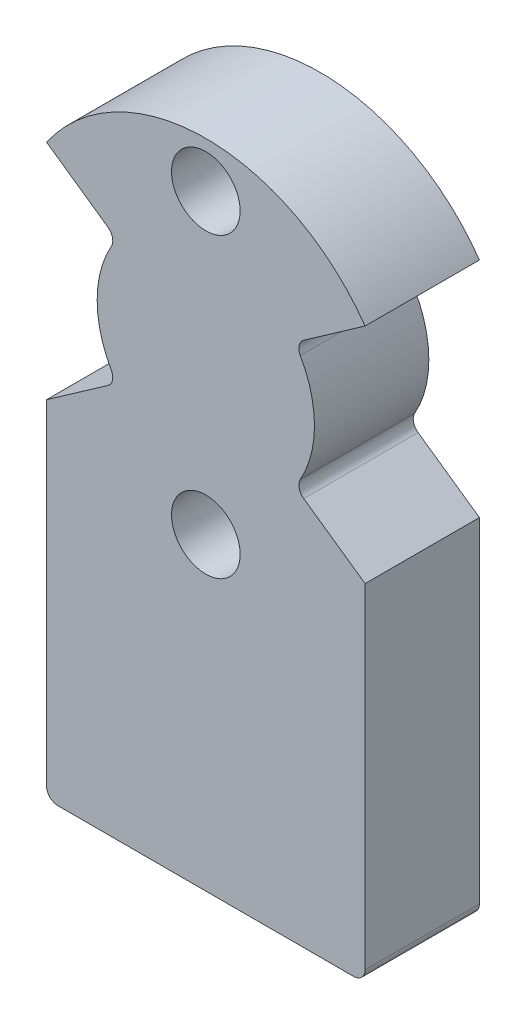
ISO-10303-21;
HEADER;
FILE_DESCRIPTION(('STEP AP214'),'2;1');
FILE_NAME('part.step','',(''),(''),'','','');
FILE_SCHEMA(('AUTOMOTIVE_DESIGN { 1 0 10303 214 1 1 1 1 }'));
ENDSEC;
DATA;
#1=APPLICATION_CONTEXT('core data for automotive mechanical design processes');
#2=APPLICATION_PROTOCOL_DEFINITION('international standard','automotive_design',2000,#1);
#3=PRODUCT_CONTEXT('',#1,'mechanical');
#4=PRODUCT('Part','Part','',(#3));
#5=PRODUCT_RELATED_PRODUCT_CATEGORY('part','',(#4));
#6=PRODUCT_DEFINITION_FORMATION('','',#4);
#7=PRODUCT_DEFINITION_CONTEXT('part definition',#1,'design');
#8=PRODUCT_DEFINITION('design','',#6,#7);
#9=PRODUCT_DEFINITION_SHAPE('','',#8);
#10=(LENGTH_UNIT() NAMED_UNIT(*) SI_UNIT(.MILLI.,.METRE.));
#11=(NAMED_UNIT(*) PLANE_ANGLE_UNIT() SI_UNIT($,.RADIAN.));
#12=(NAMED_UNIT(*) SI_UNIT($,.STERADIAN.) SOLID_ANGLE_UNIT());
#13=UNCERTAINTY_MEASURE_WITH_UNIT(LENGTH_MEASURE(1.E-05),#10,'distance_accuracy_value','');
#14=(GEOMETRIC_REPRESENTATION_CONTEXT(3) GLOBAL_UNCERTAINTY_ASSIGNED_CONTEXT((#13)) GLOBAL_UNIT_ASSIGNED_CONTEXT((#10,
#11,#12)) REPRESENTATION_CONTEXT('',''));
#15=CARTESIAN_POINT('',(0.,0.,0.));
#16=DIRECTION('',(0.,0.,1.));
#17=DIRECTION('',(1.,0.,0.));
#18=AXIS2_PLACEMENT_3D('',#15,#16,#17);
#19=CARTESIAN_POINT('',(0.,0.,5.));
#20=DIRECTION('',(0.,0.,1.));
#21=DIRECTION('',(1.,0.,0.));
#22=AXIS2_PLACEMENT_3D('',#19,#20,#21);
#23=PLANE('',#22);
#24=CARTESIAN_POINT('',(0.,6.5,5.));
#25=DIRECTION('',(0.,0.,1.));
#26=DIRECTION('',(1.,0.,0.));
#27=AXIS2_PLACEMENT_3D('',#24,#25,#26);
#28=CIRCLE('',#27,1.5);
#29=CARTESIAN_POINT('',(1.5,6.5,5.));
#30=VERTEX_POINT('',#29);
#31=EDGE_CURVE('E224',#30,#30,#28,.T.);
#32=ORIENTED_EDGE('',*,*,#31,.F.);
#33=EDGE_LOOP('',(#32));
#34=FACE_BOUND('',#33,.T.);
#35=CARTESIAN_POINT('',(0.,-6.5,5.));
#36=DIRECTION('',(0.,0.,1.));
#37=DIRECTION('',(1.,0.,0.));
#38=AXIS2_PLACEMENT_3D('',#35,#36,#37);
#39=CIRCLE('',#38,1.5);
#40=CARTESIAN_POINT('',(1.5,-6.5,5.));
#41=VERTEX_POINT('',#40);
#42=EDGE_CURVE('E219',#41,#41,#39,.T.);
#43=ORIENTED_EDGE('',*,*,#42,.F.);
#44=EDGE_LOOP('',(#43));
#45=FACE_BOUND('',#44,.T.);
#46=DIRECTION('',(-1.,0.,0.));
#47=VECTOR('',#46,1.);
#48=CARTESIAN_POINT('',(0.,-20.,5.));
#49=LINE('',#48,#47);
#50=CARTESIAN_POINT('',(6.46279237645642,-20.,5.));
#51=VERTEX_POINT('',#50);
#52=CARTESIAN_POINT('',(-6.46279237645642,-20.,5.));
#53=VERTEX_POINT('',#52);
#54=EDGE_CURVE('E190',#51,#53,#49,.T.);
#55=ORIENTED_EDGE('',*,*,#54,.F.);
#56=CARTESIAN_POINT('',(6.46279237645642,-19.5,5.));
#57=DIRECTION('',(0.,0.,1.));
#58=DIRECTION('',(1.,0.,0.));
#59=AXIS2_PLACEMENT_3D('',#56,#57,#58);
#60=CIRCLE('',#59,0.5);
#61=CARTESIAN_POINT('',(6.96279237645642,-19.5,5.));
#62=VERTEX_POINT('',#61);
#63=EDGE_CURVE('E46',#51,#62,#60,.T.);
#64=ORIENTED_EDGE('',*,*,#63,.T.);
#65=DIRECTION('',(0.,-1.,0.));
#66=VECTOR('',#65,1.);
#67=CARTESIAN_POINT('',(6.96279237645642,0.,5.));
#68=LINE('',#67,#66);
#69=CARTESIAN_POINT('',(6.96279237645642,-4.8753997089839,5.));
#70=VERTEX_POINT('',#69);
#71=EDGE_CURVE('E283',#70,#62,#68,.T.);
#72=ORIENTED_EDGE('',*,*,#71,.F.);
#73=DIRECTION('',(0.819152044288991,-0.573576436351047,0.));
#74=VECTOR('',#73,1.);
#75=CARTESIAN_POINT('',(0.,0.,5.));
#76=LINE('',#75,#74);
#77=CARTESIAN_POINT('',(4.28100018480391,-2.99758860047687,5.));
#78=VERTEX_POINT('',#77);
#79=EDGE_CURVE('E168',#78,#70,#76,.T.);
#80=ORIENTED_EDGE('',*,*,#79,.F.);
#81=CARTESIAN_POINT('',(4.56778840297943,-2.58801257833237,5.));
#82=DIRECTION('',(0.,0.,1.));
#83=DIRECTION('',(1.,0.,0.));
#84=AXIS2_PLACEMENT_3D('',#81,#82,#83);
#85=CIRCLE('',#84,0.5);
#86=CARTESIAN_POINT('',(4.13276093602901,-2.34153518991977,5.));
#87=VERTEX_POINT('',#86);
#88=EDGE_CURVE('E270',#78,#87,#85,.F.);
#89=ORIENTED_EDGE('',*,*,#88,.T.);
#90=CARTESIAN_POINT('',(0.,0.,5.));
#91=DIRECTION('',(0.,0.,1.));
#92=DIRECTION('',(1.,0.,0.));
#93=AXIS2_PLACEMENT_3D('',#90,#91,#92);
#94=CIRCLE('',#93,4.75);
#95=CARTESIAN_POINT('',(4.13276093602901,2.34153518991977,5.));
#96=VERTEX_POINT('',#95);
#97=EDGE_CURVE('E161',#87,#96,#94,.T.);
#98=ORIENTED_EDGE('',*,*,#97,.T.);
#99=CARTESIAN_POINT('',(4.56778840297943,2.58801257833237,5.));
#100=DIRECTION('',(0.,0.,1.));
#101=DIRECTION('',(1.,0.,0.));
#102=AXIS2_PLACEMENT_3D('',#99,#100,#101);
#103=CIRCLE('',#102,0.5);
#104=CARTESIAN_POINT('',(4.28100018480391,2.99758860047687,5.));
#105=VERTEX_POINT('',#104);
#106=EDGE_CURVE('E267',#96,#105,#103,.F.);
#107=ORIENTED_EDGE('',*,*,#106,.T.);
#108=DIRECTION('',(0.819152044288991,0.573576436351047,0.));
#109=VECTOR('',#108,1.);
#110=CARTESIAN_POINT('',(0.,0.,5.));
#111=LINE('',#110,#109);
#112=CARTESIAN_POINT('',(6.96279237645642,4.8753997089839,5.));
#113=VERTEX_POINT('',#112);
#114=EDGE_CURVE('E193',#105,#113,#111,.T.);
#115=ORIENTED_EDGE('',*,*,#114,.T.);
#116=CARTESIAN_POINT('',(0.,0.,5.));
#117=DIRECTION('',(0.,0.,1.));
#118=DIRECTION('',(1.,0.,0.));
#119=AXIS2_PLACEMENT_3D('',#116,#117,#118);
#120=CIRCLE('',#119,8.5);
#121=CARTESIAN_POINT('',(-6.96279237645642,4.8753997089839,5.));
#122=VERTEX_POINT('',#121);
#123=EDGE_CURVE('E232',#113,#122,#120,.T.);
#124=ORIENTED_EDGE('',*,*,#123,.T.);
#125=DIRECTION('',(-0.819152044288991,0.573576436351047,0.));
#126=VECTOR('',#125,1.);
#127=CARTESIAN_POINT('',(0.,0.,5.));
#128=LINE('',#127,#126);
#129=CARTESIAN_POINT('',(-4.28100018480391,2.99758860047687,5.));
#130=VERTEX_POINT('',#129);
#131=EDGE_CURVE('E209',#130,#122,#128,.T.);
#132=ORIENTED_EDGE('',*,*,#131,.F.);
#133=CARTESIAN_POINT('',(-4.56778840297943,2.58801257833237,5.));
#134=DIRECTION('',(0.,0.,1.));
#135=DIRECTION('',(1.,0.,0.));
#136=AXIS2_PLACEMENT_3D('',#133,#134,#135);
#137=CIRCLE('',#136,0.5);
#138=CARTESIAN_POINT('',(-4.13276093602901,2.34153518991977,5.));
#139=VERTEX_POINT('',#138);
#140=EDGE_CURVE('E263',#130,#139,#137,.F.);
#141=ORIENTED_EDGE('',*,*,#140,.T.);
#142=CARTESIAN_POINT('',(0.,0.,5.));
#143=DIRECTION('',(0.,0.,-1.));
#144=DIRECTION('',(-1.,0.,0.));
#145=AXIS2_PLACEMENT_3D('',#142,#143,#144);
#146=CIRCLE('',#145,4.75);
#147=CARTESIAN_POINT('',(-4.13276093602901,-2.34153518991977,5.));
#148=VERTEX_POINT('',#147);
#149=EDGE_CURVE('E203',#148,#139,#146,.T.);
#150=ORIENTED_EDGE('',*,*,#149,.F.);
#151=CARTESIAN_POINT('',(-4.56778840297943,-2.58801257833237,5.));
#152=DIRECTION('',(0.,0.,1.));
#153=DIRECTION('',(1.,0.,0.));
#154=AXIS2_PLACEMENT_3D('',#151,#152,#153);
#155=CIRCLE('',#154,0.5);
#156=CARTESIAN_POINT('',(-4.28100018480391,-2.99758860047687,5.));
#157=VERTEX_POINT('',#156);
#158=EDGE_CURVE('E259',#148,#157,#155,.F.);
#159=ORIENTED_EDGE('',*,*,#158,.T.);
#160=DIRECTION('',(-0.819152044288991,-0.573576436351047,0.));
#161=VECTOR('',#160,1.);
#162=CARTESIAN_POINT('',(0.,0.,5.));
#163=LINE('',#162,#161);
#164=CARTESIAN_POINT('',(-6.96279237645642,-4.8753997089839,5.));
#165=VERTEX_POINT('',#164);
#166=EDGE_CURVE('E206',#157,#165,#163,.T.);
#167=ORIENTED_EDGE('',*,*,#166,.T.);
#168=DIRECTION('',(0.,-1.,0.));
#169=VECTOR('',#168,1.);
#170=CARTESIAN_POINT('',(-6.96279237645642,0.,5.));
#171=LINE('',#170,#169);
#172=CARTESIAN_POINT('',(-6.96279237645642,-19.5,5.));
#173=VERTEX_POINT('',#172);
#174=EDGE_CURVE('E183',#165,#173,#171,.T.);
#175=ORIENTED_EDGE('',*,*,#174,.T.);
#176=CARTESIAN_POINT('',(-6.46279237645642,-19.5,5.));
#177=DIRECTION('',(0.,0.,1.));
#178=DIRECTION('',(1.,0.,0.));
#179=AXIS2_PLACEMENT_3D('',#176,#177,#178);
#180=CIRCLE('',#179,0.5);
#181=EDGE_CURVE('E58',#173,#53,#180,.T.);
#182=ORIENTED_EDGE('',*,*,#181,.T.);
#183=EDGE_LOOP('',(#55,#64,#72,#80,#89,#98,#107,#115,#124,#132,#141,#150,#159,#167,#175,#182));
#184=FACE_BOUND('',#183,.T.);
#185=ADVANCED_FACE('F38',(#34,#45,#184),#23,.T.);
#186=CARTESIAN_POINT('',(0.,0.,0.));
#187=DIRECTION('',(0.,0.,1.));
#188=DIRECTION('',(1.,0.,0.));
#189=AXIS2_PLACEMENT_3D('',#186,#187,#188);
#190=PLANE('',#189);
#191=CARTESIAN_POINT('',(0.,6.5,0.));
#192=DIRECTION('',(0.,0.,1.));
#193=DIRECTION('',(1.,0.,0.));
#194=AXIS2_PLACEMENT_3D('',#191,#192,#193);
#195=CIRCLE('',#194,1.5);
#196=CARTESIAN_POINT('',(1.5,6.5,0.));
#197=VERTEX_POINT('',#196);
#198=EDGE_CURVE('E220',#197,#197,#195,.T.);
#199=ORIENTED_EDGE('',*,*,#198,.T.);
#200=EDGE_LOOP('',(#199));
#201=FACE_BOUND('',#200,.T.);
#202=CARTESIAN_POINT('',(0.,-6.5,0.));
#203=DIRECTION('',(0.,0.,1.));
#204=DIRECTION('',(1.,0.,0.));
#205=AXIS2_PLACEMENT_3D('',#202,#203,#204);
#206=CIRCLE('',#205,1.5);
#207=CARTESIAN_POINT('',(1.5,-6.5,0.));
#208=VERTEX_POINT('',#207);
#209=EDGE_CURVE('E227',#208,#208,#206,.T.);
#210=ORIENTED_EDGE('',*,*,#209,.T.);
#211=EDGE_LOOP('',(#210));
#212=FACE_BOUND('',#211,.T.);
#213=DIRECTION('',(0.,-1.,0.));
#214=VECTOR('',#213,1.);
#215=CARTESIAN_POINT('',(6.96279237645642,0.,0.));
#216=LINE('',#215,#214);
#217=CARTESIAN_POINT('',(6.96279237645643,-4.8753997089839,0.));
#218=VERTEX_POINT('',#217);
#219=CARTESIAN_POINT('',(6.96279237645642,-19.5,0.));
#220=VERTEX_POINT('',#219);
#221=EDGE_CURVE('E156',#218,#220,#216,.T.);
#222=ORIENTED_EDGE('',*,*,#221,.T.);
#223=CARTESIAN_POINT('',(6.46279237645642,-19.5,0.));
#224=DIRECTION('',(0.,0.,1.));
#225=DIRECTION('',(1.,0.,0.));
#226=AXIS2_PLACEMENT_3D('',#223,#224,#225);
#227=CIRCLE('',#226,0.5);
#228=CARTESIAN_POINT('',(6.46279237645642,-20.,0.));
#229=VERTEX_POINT('',#228);
#230=EDGE_CURVE('E275',#220,#229,#227,.F.);
#231=ORIENTED_EDGE('',*,*,#230,.T.);
#232=DIRECTION('',(-1.,0.,0.));
#233=VECTOR('',#232,1.);
#234=CARTESIAN_POINT('',(0.,-20.,0.));
#235=LINE('',#234,#233);
#236=CARTESIAN_POINT('',(-6.46279237645642,-20.,0.));
#237=VERTEX_POINT('',#236);
#238=EDGE_CURVE('E179',#229,#237,#235,.T.);
#239=ORIENTED_EDGE('',*,*,#238,.T.);
#240=CARTESIAN_POINT('',(-6.46279237645642,-19.5,0.));
#241=DIRECTION('',(0.,0.,1.));
#242=DIRECTION('',(1.,0.,0.));
#243=AXIS2_PLACEMENT_3D('',#240,#241,#242);
#244=CIRCLE('',#243,0.5);
#245=CARTESIAN_POINT('',(-6.96279237645642,-19.5,0.));
#246=VERTEX_POINT('',#245);
#247=EDGE_CURVE('E273',#237,#246,#244,.F.);
#248=ORIENTED_EDGE('',*,*,#247,.T.);
#249=DIRECTION('',(0.,-1.,0.));
#250=VECTOR('',#249,1.);
#251=CARTESIAN_POINT('',(-6.96279237645642,0.,0.));
#252=LINE('',#251,#250);
#253=CARTESIAN_POINT('',(-6.96279237645642,-4.8753997089839,0.));
#254=VERTEX_POINT('',#253);
#255=EDGE_CURVE('E180',#254,#246,#252,.T.);
#256=ORIENTED_EDGE('',*,*,#255,.F.);
#257=DIRECTION('',(-0.819152044288991,-0.573576436351047,0.));
#258=VECTOR('',#257,1.);
#259=CARTESIAN_POINT('',(0.,0.,0.));
#260=LINE('',#259,#258);
#261=CARTESIAN_POINT('',(-4.28100018480391,-2.99758860047687,0.));
#262=VERTEX_POINT('',#261);
#263=EDGE_CURVE('E214',#262,#254,#260,.T.);
#264=ORIENTED_EDGE('',*,*,#263,.F.);
#265=CARTESIAN_POINT('',(-4.56778840297943,-2.58801257833237,0.));
#266=DIRECTION('',(0.,0.,1.));
#267=DIRECTION('',(1.,0.,0.));
#268=AXIS2_PLACEMENT_3D('',#265,#266,#267);
#269=CIRCLE('',#268,0.5);
#270=CARTESIAN_POINT('',(-4.13276093602901,-2.34153518991977,0.));
#271=VERTEX_POINT('',#270);
#272=EDGE_CURVE('E257',#262,#271,#269,.T.);
#273=ORIENTED_EDGE('',*,*,#272,.T.);
#274=CARTESIAN_POINT('',(0.,0.,0.));
#275=DIRECTION('',(0.,0.,-1.));
#276=DIRECTION('',(-1.,0.,0.));
#277=AXIS2_PLACEMENT_3D('',#274,#275,#276);
#278=CIRCLE('',#277,4.75);
#279=CARTESIAN_POINT('',(-4.13276093602901,2.34153518991977,0.));
#280=VERTEX_POINT('',#279);
#281=EDGE_CURVE('E202',#271,#280,#278,.T.);
#282=ORIENTED_EDGE('',*,*,#281,.T.);
#283=CARTESIAN_POINT('',(-4.56778840297943,2.58801257833237,0.));
#284=DIRECTION('',(0.,0.,1.));
#285=DIRECTION('',(1.,0.,0.));
#286=AXIS2_PLACEMENT_3D('',#283,#284,#285);
#287=CIRCLE('',#286,0.5);
#288=CARTESIAN_POINT('',(-4.28100018480391,2.99758860047687,0.));
#289=VERTEX_POINT('',#288);
#290=EDGE_CURVE('E261',#280,#289,#287,.T.);
#291=ORIENTED_EDGE('',*,*,#290,.T.);
#292=DIRECTION('',(-0.819152044288991,0.573576436351047,0.));
#293=VECTOR('',#292,1.);
#294=CARTESIAN_POINT('',(0.,0.,0.));
#295=LINE('',#294,#293);
#296=CARTESIAN_POINT('',(-6.96279237645642,4.8753997089839,0.));
#297=VERTEX_POINT('',#296);
#298=EDGE_CURVE('E207',#289,#297,#295,.T.);
#299=ORIENTED_EDGE('',*,*,#298,.T.);
#300=CARTESIAN_POINT('',(0.,0.,0.));
#301=DIRECTION('',(0.,0.,1.));
#302=DIRECTION('',(1.,0.,0.));
#303=AXIS2_PLACEMENT_3D('',#300,#301,#302);
#304=CIRCLE('',#303,8.5);
#305=CARTESIAN_POINT('',(6.96279237645642,4.8753997089839,0.));
#306=VERTEX_POINT('',#305);
#307=EDGE_CURVE('E223',#306,#297,#304,.T.);
#308=ORIENTED_EDGE('',*,*,#307,.F.);
#309=DIRECTION('',(0.819152044288991,0.573576436351047,0.));
#310=VECTOR('',#309,1.);
#311=CARTESIAN_POINT('',(0.,0.,0.));
#312=LINE('',#311,#310);
#313=CARTESIAN_POINT('',(4.28100018480391,2.99758860047687,0.));
#314=VERTEX_POINT('',#313);
#315=EDGE_CURVE('E162',#314,#306,#312,.T.);
#316=ORIENTED_EDGE('',*,*,#315,.F.);
#317=CARTESIAN_POINT('',(4.56778840297943,2.58801257833237,0.));
#318=DIRECTION('',(0.,0.,1.));
#319=DIRECTION('',(1.,0.,0.));
#320=AXIS2_PLACEMENT_3D('',#317,#318,#319);
#321=CIRCLE('',#320,0.5);
#322=CARTESIAN_POINT('',(4.13276093602901,2.34153518991977,0.));
#323=VERTEX_POINT('',#322);
#324=EDGE_CURVE('E265',#314,#323,#321,.T.);
#325=ORIENTED_EDGE('',*,*,#324,.T.);
#326=CARTESIAN_POINT('',(0.,0.,0.));
#327=DIRECTION('',(0.,0.,1.));
#328=DIRECTION('',(1.,0.,0.));
#329=AXIS2_PLACEMENT_3D('',#326,#327,#328);
#330=CIRCLE('',#329,4.75);
#331=CARTESIAN_POINT('',(4.13276093602901,-2.34153518991977,0.));
#332=VERTEX_POINT('',#331);
#333=EDGE_CURVE('E172',#332,#323,#330,.T.);
#334=ORIENTED_EDGE('',*,*,#333,.F.);
#335=CARTESIAN_POINT('',(4.56778840297943,-2.58801257833237,0.));
#336=DIRECTION('',(0.,0.,1.));
#337=DIRECTION('',(1.,0.,0.));
#338=AXIS2_PLACEMENT_3D('',#335,#336,#337);
#339=CIRCLE('',#338,0.5);
#340=CARTESIAN_POINT('',(4.28100018480391,-2.99758860047687,0.));
#341=VERTEX_POINT('',#340);
#342=EDGE_CURVE('E158',#332,#341,#339,.T.);
#343=ORIENTED_EDGE('',*,*,#342,.T.);
#344=DIRECTION('',(0.819152044288991,-0.573576436351047,0.));
#345=VECTOR('',#344,1.);
#346=CARTESIAN_POINT('',(0.,0.,0.));
#347=LINE('',#346,#345);
#348=EDGE_CURVE('E152',#341,#218,#347,.T.);
#349=ORIENTED_EDGE('',*,*,#348,.T.);
#350=EDGE_LOOP('',(#222,#231,#239,#248,#256,#264,#273,#282,#291,#299,#308,#316,#325,#334,#343,#349));
#351=FACE_BOUND('',#350,.T.);
#352=ADVANCED_FACE('F154',(#201,#212,#351),#190,.F.);
#353=CARTESIAN_POINT('',(0.,0.,5.));
#354=DIRECTION('',(0.,0.,-1.));
#355=DIRECTION('',(-1.,0.,0.));
#356=AXIS2_PLACEMENT_3D('',#353,#354,#355);
#357=CYLINDRICAL_SURFACE('',#356,8.5);
#358=ORIENTED_EDGE('',*,*,#123,.F.);
#359=DIRECTION('',(0.,0.,-1.));
#360=VECTOR('',#359,1.);
#361=CARTESIAN_POINT('',(6.96279237645642,4.8753997089839,5.));
#362=LINE('',#361,#360);
#363=EDGE_CURVE('E196',#113,#306,#362,.T.);
#364=ORIENTED_EDGE('',*,*,#363,.T.);
#365=ORIENTED_EDGE('',*,*,#307,.T.);
#366=DIRECTION('',(0.,0.,-1.));
#367=VECTOR('',#366,1.);
#368=CARTESIAN_POINT('',(-6.96279237645642,4.8753997089839,5.));
#369=LINE('',#368,#367);
#370=EDGE_CURVE('E211',#122,#297,#369,.T.);
#371=ORIENTED_EDGE('',*,*,#370,.F.);
#372=EDGE_LOOP('',(#358,#364,#365,#371));
#373=FACE_BOUND('',#372,.T.);
#374=ADVANCED_FACE('F322',(#373),#357,.T.);
#375=CARTESIAN_POINT('',(0.,-6.5,0.));
#376=DIRECTION('',(0.,0.,1.));
#377=DIRECTION('',(1.,0.,0.));
#378=AXIS2_PLACEMENT_3D('',#375,#376,#377);
#379=CYLINDRICAL_SURFACE('',#378,1.5);
#380=ORIENTED_EDGE('',*,*,#209,.F.);
#381=EDGE_LOOP('',(#380));
#382=FACE_BOUND('',#381,.T.);
#383=ORIENTED_EDGE('',*,*,#42,.T.);
#384=EDGE_LOOP('',(#383));
#385=FACE_BOUND('',#384,.T.);
#386=ADVANCED_FACE('F358',(#382,#385),#379,.F.);
#387=CARTESIAN_POINT('',(0.,6.5,0.));
#388=DIRECTION('',(0.,0.,1.));
#389=DIRECTION('',(1.,0.,0.));
#390=AXIS2_PLACEMENT_3D('',#387,#388,#389);
#391=CYLINDRICAL_SURFACE('',#390,1.5);
#392=ORIENTED_EDGE('',*,*,#198,.F.);
#393=EDGE_LOOP('',(#392));
#394=FACE_BOUND('',#393,.T.);
#395=ORIENTED_EDGE('',*,*,#31,.T.);
#396=EDGE_LOOP('',(#395));
#397=FACE_BOUND('',#396,.T.);
#398=ADVANCED_FACE('F494',(#394,#397),#391,.F.);
#399=CARTESIAN_POINT('',(0.,0.,5.));
#400=DIRECTION('',(0.,0.,-1.));
#401=DIRECTION('',(-1.,0.,0.));
#402=AXIS2_PLACEMENT_3D('',#399,#400,#401);
#403=CYLINDRICAL_SURFACE('',#402,4.75);
#404=ORIENTED_EDGE('',*,*,#281,.F.);
#405=DIRECTION('',(0.,0.,-1.));
#406=VECTOR('',#405,1.);
#407=CARTESIAN_POINT('',(-4.13276093602901,-2.34153518991977,5.));
#408=LINE('',#407,#406);
#409=EDGE_CURVE('E243',#271,#148,#408,.F.);
#410=ORIENTED_EDGE('',*,*,#409,.T.);
#411=ORIENTED_EDGE('',*,*,#149,.T.);
#412=DIRECTION('',(0.,0.,-1.));
#413=VECTOR('',#412,1.);
#414=CARTESIAN_POINT('',(-4.13276093602901,2.34153518991977,5.));
#415=LINE('',#414,#413);
#416=EDGE_CURVE('E240',#139,#280,#415,.T.);
#417=ORIENTED_EDGE('',*,*,#416,.T.);
#418=EDGE_LOOP('',(#404,#410,#411,#417));
#419=FACE_BOUND('',#418,.T.);
#420=ADVANCED_FACE('F305',(#419),#403,.T.);
#421=CARTESIAN_POINT('',(0.,0.,5.));
#422=DIRECTION('',(-0.573576436351047,-0.819152044288991,0.));
#423=DIRECTION('',(0.819152044288991,-0.573576436351047,0.));
#424=AXIS2_PLACEMENT_3D('',#421,#422,#423);
#425=PLANE('',#424);
#426=ORIENTED_EDGE('',*,*,#298,.F.);
#427=DIRECTION('',(0.,0.,1.));
#428=VECTOR('',#427,1.);
#429=CARTESIAN_POINT('',(-4.28100018480391,2.99758860047687,5.));
#430=LINE('',#429,#428);
#431=EDGE_CURVE('E245',#289,#130,#430,.T.);
#432=ORIENTED_EDGE('',*,*,#431,.T.);
#433=ORIENTED_EDGE('',*,*,#131,.T.);
#434=ORIENTED_EDGE('',*,*,#370,.T.);
#435=EDGE_LOOP('',(#426,#432,#433,#434));
#436=FACE_BOUND('',#435,.T.);
#437=ADVANCED_FACE('F318',(#436),#425,.T.);
#438=CARTESIAN_POINT('',(0.,0.,5.));
#439=DIRECTION('',(0.573576436351047,-0.819152044288991,0.));
#440=DIRECTION('',(0.819152044288991,0.573576436351047,0.));
#441=AXIS2_PLACEMENT_3D('',#438,#439,#440);
#442=PLANE('',#441);
#443=ORIENTED_EDGE('',*,*,#166,.F.);
#444=DIRECTION('',(0.,0.,-1.));
#445=VECTOR('',#444,1.);
#446=CARTESIAN_POINT('',(-4.28100018480391,-2.99758860047687,5.));
#447=LINE('',#446,#445);
#448=EDGE_CURVE('E235',#157,#262,#447,.T.);
#449=ORIENTED_EDGE('',*,*,#448,.T.);
#450=ORIENTED_EDGE('',*,*,#263,.T.);
#451=DIRECTION('',(0.,0.,-1.));
#452=VECTOR('',#451,1.);
#453=CARTESIAN_POINT('',(-6.96279237645642,-4.8753997089839,5.));
#454=LINE('',#453,#452);
#455=EDGE_CURVE('E173',#165,#254,#454,.T.);
#456=ORIENTED_EDGE('',*,*,#455,.F.);
#457=EDGE_LOOP('',(#443,#449,#450,#456));
#458=FACE_BOUND('',#457,.T.);
#459=ADVANCED_FACE('F299',(#458),#442,.F.);
#460=CARTESIAN_POINT('',(0.,0.,5.));
#461=DIRECTION('',(0.,0.,-1.));
#462=DIRECTION('',(-1.,0.,0.));
#463=AXIS2_PLACEMENT_3D('',#460,#461,#462);
#464=CYLINDRICAL_SURFACE('',#463,4.75);
#465=ORIENTED_EDGE('',*,*,#333,.T.);
#466=DIRECTION('',(0.,0.,-1.));
#467=VECTOR('',#466,1.);
#468=CARTESIAN_POINT('',(4.13276093602901,2.34153518991977,5.));
#469=LINE('',#468,#467);
#470=EDGE_CURVE('E253',#323,#96,#469,.F.);
#471=ORIENTED_EDGE('',*,*,#470,.T.);
#472=ORIENTED_EDGE('',*,*,#97,.F.);
#473=DIRECTION('',(0.,0.,-1.));
#474=VECTOR('',#473,1.);
#475=CARTESIAN_POINT('',(4.13276093602901,-2.34153518991977,5.));
#476=LINE('',#475,#474);
#477=EDGE_CURVE('E250',#87,#332,#476,.T.);
#478=ORIENTED_EDGE('',*,*,#477,.T.);
#479=EDGE_LOOP('',(#465,#471,#472,#478));
#480=FACE_BOUND('',#479,.T.);
#481=ADVANCED_FACE('F335',(#480),#464,.T.);
#482=CARTESIAN_POINT('',(0.,0.,5.));
#483=DIRECTION('',(0.573576436351047,0.819152044288991,0.));
#484=DIRECTION('',(-0.819152044288991,0.573576436351047,0.));
#485=AXIS2_PLACEMENT_3D('',#482,#483,#484);
#486=PLANE('',#485);
#487=ORIENTED_EDGE('',*,*,#348,.F.);
#488=DIRECTION('',(0.,0.,-1.));
#489=VECTOR('',#488,1.);
#490=CARTESIAN_POINT('',(4.28100018480391,-2.99758860047687,5.));
#491=LINE('',#490,#489);
#492=EDGE_CURVE('E255',#341,#78,#491,.F.);
#493=ORIENTED_EDGE('',*,*,#492,.T.);
#494=ORIENTED_EDGE('',*,*,#79,.T.);
#495=DIRECTION('',(0.,0.,-1.));
#496=VECTOR('',#495,1.);
#497=CARTESIAN_POINT('',(6.96279237645643,-4.8753997089839,5.));
#498=LINE('',#497,#496);
#499=EDGE_CURVE('E165',#70,#218,#498,.T.);
#500=ORIENTED_EDGE('',*,*,#499,.T.);
#501=EDGE_LOOP('',(#487,#493,#494,#500));
#502=FACE_BOUND('',#501,.T.);
#503=ADVANCED_FACE('F166',(#502),#486,.T.);
#504=CARTESIAN_POINT('',(0.,0.,5.));
#505=DIRECTION('',(-0.573576436351047,0.819152044288991,0.));
#506=DIRECTION('',(-0.819152044288991,-0.573576436351047,0.));
#507=AXIS2_PLACEMENT_3D('',#504,#505,#506);
#508=PLANE('',#507);
#509=ORIENTED_EDGE('',*,*,#114,.F.);
#510=DIRECTION('',(0.,0.,1.));
#511=VECTOR('',#510,1.);
#512=CARTESIAN_POINT('',(4.28100018480391,2.99758860047687,0.));
#513=LINE('',#512,#511);
#514=EDGE_CURVE('E247',#105,#314,#513,.F.);
#515=ORIENTED_EDGE('',*,*,#514,.T.);
#516=ORIENTED_EDGE('',*,*,#315,.T.);
#517=ORIENTED_EDGE('',*,*,#363,.F.);
#518=EDGE_LOOP('',(#509,#515,#516,#517));
#519=FACE_BOUND('',#518,.T.);
#520=ADVANCED_FACE('F327',(#519),#508,.F.);
#521=CARTESIAN_POINT('',(-6.96279237645642,0.,5.));
#522=DIRECTION('',(1.,0.,0.));
#523=DIRECTION('',(0.,0.,-1.));
#524=AXIS2_PLACEMENT_3D('',#521,#522,#523);
#525=PLANE('',#524);
#526=ORIENTED_EDGE('',*,*,#255,.T.);
#527=DIRECTION('',(0.,0.,-1.));
#528=VECTOR('',#527,1.);
#529=CARTESIAN_POINT('',(-6.96279237645642,-19.5,5.));
#530=LINE('',#529,#528);
#531=EDGE_CURVE('E11',#246,#173,#530,.F.);
#532=ORIENTED_EDGE('',*,*,#531,.T.);
#533=ORIENTED_EDGE('',*,*,#174,.F.);
#534=ORIENTED_EDGE('',*,*,#455,.T.);
#535=EDGE_LOOP('',(#526,#532,#533,#534));
#536=FACE_BOUND('',#535,.T.);
#537=ADVANCED_FACE('F295',(#536),#525,.F.);
#538=CARTESIAN_POINT('',(0.,-20.,5.));
#539=DIRECTION('',(0.,-1.,0.));
#540=DIRECTION('',(0.,0.,-1.));
#541=AXIS2_PLACEMENT_3D('',#538,#539,#540);
#542=PLANE('',#541);
#543=ORIENTED_EDGE('',*,*,#238,.F.);
#544=DIRECTION('',(0.,0.,-1.));
#545=VECTOR('',#544,1.);
#546=CARTESIAN_POINT('',(6.46279237645642,-20.,5.));
#547=LINE('',#546,#545);
#548=EDGE_CURVE('E280',#229,#51,#547,.F.);
#549=ORIENTED_EDGE('',*,*,#548,.T.);
#550=ORIENTED_EDGE('',*,*,#54,.T.);
#551=DIRECTION('',(0.,0.,-1.));
#552=VECTOR('',#551,1.);
#553=CARTESIAN_POINT('',(-6.46279237645642,-20.,0.));
#554=LINE('',#553,#552);
#555=EDGE_CURVE('E277',#53,#237,#554,.T.);
#556=ORIENTED_EDGE('',*,*,#555,.T.);
#557=EDGE_LOOP('',(#543,#549,#550,#556));
#558=FACE_BOUND('',#557,.T.);
#559=ADVANCED_FACE('F290',(#558),#542,.T.);
#560=CARTESIAN_POINT('',(6.96279237645642,0.,5.));
#561=DIRECTION('',(1.,0.,0.));
#562=DIRECTION('',(0.,0.,-1.));
#563=AXIS2_PLACEMENT_3D('',#560,#561,#562);
#564=PLANE('',#563);
#565=ORIENTED_EDGE('',*,*,#71,.T.);
#566=DIRECTION('',(0.,0.,-1.));
#567=VECTOR('',#566,1.);
#568=CARTESIAN_POINT('',(6.96279237645642,-19.5,5.));
#569=LINE('',#568,#567);
#570=EDGE_CURVE('E178',#62,#220,#569,.T.);
#571=ORIENTED_EDGE('',*,*,#570,.T.);
#572=ORIENTED_EDGE('',*,*,#221,.F.);
#573=ORIENTED_EDGE('',*,*,#499,.F.);
#574=EDGE_LOOP('',(#565,#571,#572,#573));
#575=FACE_BOUND('',#574,.T.);
#576=ADVANCED_FACE('F176',(#575),#564,.T.);
#577=CARTESIAN_POINT('',(-4.56778840297943,-2.58801257833237,5.));
#578=DIRECTION('',(0.,0.,-1.));
#579=DIRECTION('',(-1.,0.,0.));
#580=AXIS2_PLACEMENT_3D('',#577,#578,#579);
#581=CYLINDRICAL_SURFACE('',#580,0.5);
#582=ORIENTED_EDGE('',*,*,#158,.F.);
#583=ORIENTED_EDGE('',*,*,#409,.F.);
#584=ORIENTED_EDGE('',*,*,#272,.F.);
#585=ORIENTED_EDGE('',*,*,#448,.F.);
#586=EDGE_LOOP('',(#582,#583,#584,#585));
#587=FACE_BOUND('',#586,.T.);
#588=ADVANCED_FACE('F309',(#587),#581,.F.);
#589=CARTESIAN_POINT('',(-4.56778840297943,2.58801257833237,5.));
#590=DIRECTION('',(0.,0.,-1.));
#591=DIRECTION('',(-1.,0.,0.));
#592=AXIS2_PLACEMENT_3D('',#589,#590,#591);
#593=CYLINDRICAL_SURFACE('',#592,0.5);
#594=ORIENTED_EDGE('',*,*,#140,.F.);
#595=ORIENTED_EDGE('',*,*,#431,.F.);
#596=ORIENTED_EDGE('',*,*,#290,.F.);
#597=ORIENTED_EDGE('',*,*,#416,.F.);
#598=EDGE_LOOP('',(#594,#595,#596,#597));
#599=FACE_BOUND('',#598,.T.);
#600=ADVANCED_FACE('F313',(#599),#593,.F.);
#601=CARTESIAN_POINT('',(4.56778840297943,2.58801257833237,5.));
#602=DIRECTION('',(0.,0.,-1.));
#603=DIRECTION('',(-1.,0.,0.));
#604=AXIS2_PLACEMENT_3D('',#601,#602,#603);
#605=CYLINDRICAL_SURFACE('',#604,0.5);
#606=ORIENTED_EDGE('',*,*,#106,.F.);
#607=ORIENTED_EDGE('',*,*,#470,.F.);
#608=ORIENTED_EDGE('',*,*,#324,.F.);
#609=ORIENTED_EDGE('',*,*,#514,.F.);
#610=EDGE_LOOP('',(#606,#607,#608,#609));
#611=FACE_BOUND('',#610,.T.);
#612=ADVANCED_FACE('F331',(#611),#605,.F.);
#613=CARTESIAN_POINT('',(4.56778840297943,-2.58801257833237,5.));
#614=DIRECTION('',(0.,0.,-1.));
#615=DIRECTION('',(-1.,0.,0.));
#616=AXIS2_PLACEMENT_3D('',#613,#614,#615);
#617=CYLINDRICAL_SURFACE('',#616,0.5);
#618=ORIENTED_EDGE('',*,*,#88,.F.);
#619=ORIENTED_EDGE('',*,*,#492,.F.);
#620=ORIENTED_EDGE('',*,*,#342,.F.);
#621=ORIENTED_EDGE('',*,*,#477,.F.);
#622=EDGE_LOOP('',(#618,#619,#620,#621));
#623=FACE_BOUND('',#622,.T.);
#624=ADVANCED_FACE('F339',(#623),#617,.F.);
#625=CARTESIAN_POINT('',(6.46279237645642,-19.5,5.));
#626=DIRECTION('',(0.,0.,-1.));
#627=DIRECTION('',(-1.,0.,0.));
#628=AXIS2_PLACEMENT_3D('',#625,#626,#627);
#629=CYLINDRICAL_SURFACE('',#628,0.5);
#630=ORIENTED_EDGE('',*,*,#63,.F.);
#631=ORIENTED_EDGE('',*,*,#548,.F.);
#632=ORIENTED_EDGE('',*,*,#230,.F.);
#633=ORIENTED_EDGE('',*,*,#570,.F.);
#634=EDGE_LOOP('',(#630,#631,#632,#633));
#635=FACE_BOUND('',#634,.T.);
#636=ADVANCED_FACE('F287',(#635),#629,.T.);
#637=CARTESIAN_POINT('',(-6.46279237645642,-19.5,5.));
#638=DIRECTION('',(0.,0.,1.));
#639=DIRECTION('',(1.,0.,0.));
#640=AXIS2_PLACEMENT_3D('',#637,#638,#639);
#641=CYLINDRICAL_SURFACE('',#640,0.5);
#642=ORIENTED_EDGE('',*,*,#181,.F.);
#643=ORIENTED_EDGE('',*,*,#531,.F.);
#644=ORIENTED_EDGE('',*,*,#247,.F.);
#645=ORIENTED_EDGE('',*,*,#555,.F.);
#646=EDGE_LOOP('',(#642,#643,#644,#645));
#647=FACE_BOUND('',#646,.T.);
#648=ADVANCED_FACE('F40',(#647),#641,.T.);
#649=CLOSED_SHELL('',(#185,#352,#374,#386,#398,#420,#437,#459,#481,#503,#520,#537,#559,#576,
#588,#600,#612,#624,#636,#648));
#650=MANIFOLD_SOLID_BREP('B2',#649);
#651=ADVANCED_BREP_SHAPE_REPRESENTATION('',(#18,#650),#14);
#652=SHAPE_DEFINITION_REPRESENTATION(#9,#651);
ENDSEC;
END-ISO-10303-21;
